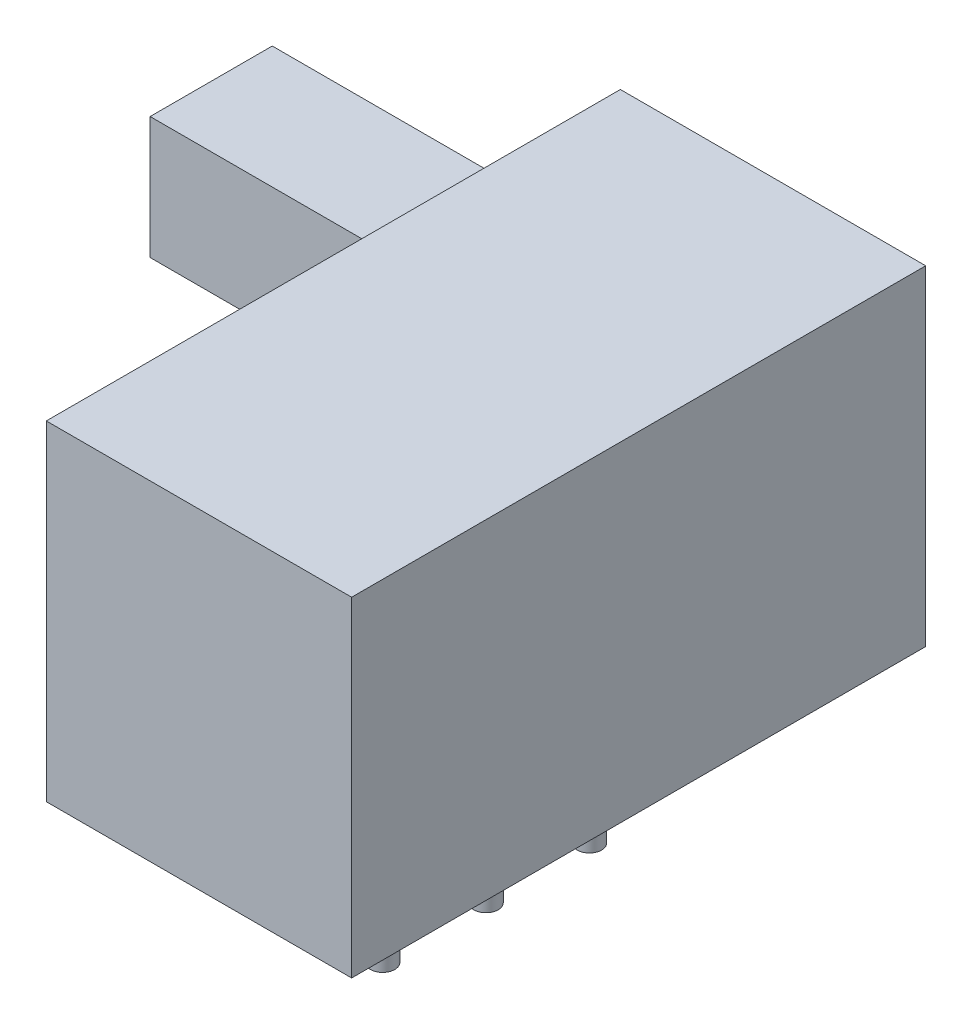
ISO-10303-21;
HEADER;
FILE_DESCRIPTION(('STEP AP214'),'2;1');
FILE_NAME('part.step','',(''),(''),'','','');
FILE_SCHEMA(('AUTOMOTIVE_DESIGN { 1 0 10303 214 1 1 1 1 }'));
ENDSEC;
DATA;
#1=APPLICATION_CONTEXT('core data for automotive mechanical design processes');
#2=APPLICATION_PROTOCOL_DEFINITION('international standard','automotive_design',2000,#1);
#3=PRODUCT_CONTEXT('',#1,'mechanical');
#4=PRODUCT('Part','Part','',(#3));
#5=PRODUCT_RELATED_PRODUCT_CATEGORY('part','',(#4));
#6=PRODUCT_DEFINITION_FORMATION('','',#4);
#7=PRODUCT_DEFINITION_CONTEXT('part definition',#1,'design');
#8=PRODUCT_DEFINITION('design','',#6,#7);
#9=PRODUCT_DEFINITION_SHAPE('','',#8);
#10=(LENGTH_UNIT() NAMED_UNIT(*) SI_UNIT(.MILLI.,.METRE.));
#11=(NAMED_UNIT(*) PLANE_ANGLE_UNIT() SI_UNIT($,.RADIAN.));
#12=(NAMED_UNIT(*) SI_UNIT($,.STERADIAN.) SOLID_ANGLE_UNIT());
#13=UNCERTAINTY_MEASURE_WITH_UNIT(LENGTH_MEASURE(1.E-05),#10,'distance_accuracy_value','');
#14=(GEOMETRIC_REPRESENTATION_CONTEXT(3) GLOBAL_UNCERTAINTY_ASSIGNED_CONTEXT((#13)) GLOBAL_UNIT_ASSIGNED_CONTEXT((#10,
#11,#12)) REPRESENTATION_CONTEXT('',''));
#15=CARTESIAN_POINT('',(0.,0.,0.));
#16=DIRECTION('',(0.,0.,1.));
#17=DIRECTION('',(1.,0.,0.));
#18=AXIS2_PLACEMENT_3D('',#15,#16,#17);
#19=CARTESIAN_POINT('',(-3.75,8.1,-7.05));
#20=DIRECTION('',(1.,0.,0.));
#21=DIRECTION('',(0.,0.,-1.));
#22=AXIS2_PLACEMENT_3D('',#19,#20,#21);
#23=PLANE('',#22);
#24=DIRECTION('',(0.,0.,1.));
#25=VECTOR('',#24,1.);
#26=CARTESIAN_POINT('',(-3.75,0.,-7.05));
#27=LINE('',#26,#25);
#28=CARTESIAN_POINT('',(-3.75,0.,-7.05));
#29=VERTEX_POINT('',#28);
#30=CARTESIAN_POINT('',(-3.75,0.,7.05));
#31=VERTEX_POINT('',#30);
#32=EDGE_CURVE('E143',#29,#31,#27,.T.);
#33=ORIENTED_EDGE('',*,*,#32,.T.);
#34=DIRECTION('',(0.,-1.,0.));
#35=VECTOR('',#34,1.);
#36=CARTESIAN_POINT('',(-3.75,8.1,7.05));
#37=LINE('',#36,#35);
#38=CARTESIAN_POINT('',(-3.75,8.1,7.05));
#39=VERTEX_POINT('',#38);
#40=EDGE_CURVE('E180',#39,#31,#37,.T.);
#41=ORIENTED_EDGE('',*,*,#40,.F.);
#42=DIRECTION('',(0.,0.,1.));
#43=VECTOR('',#42,1.);
#44=CARTESIAN_POINT('',(-3.75,8.1,-7.05));
#45=LINE('',#44,#43);
#46=CARTESIAN_POINT('',(-3.75,8.1,-7.05));
#47=VERTEX_POINT('',#46);
#48=EDGE_CURVE('E144',#47,#39,#45,.T.);
#49=ORIENTED_EDGE('',*,*,#48,.F.);
#50=DIRECTION('',(0.,-1.,0.));
#51=VECTOR('',#50,1.);
#52=CARTESIAN_POINT('',(-3.75,8.1,-7.05));
#53=LINE('',#52,#51);
#54=EDGE_CURVE('E158',#47,#29,#53,.T.);
#55=ORIENTED_EDGE('',*,*,#54,.T.);
#56=EDGE_LOOP('',(#33,#41,#49,#55));
#57=FACE_BOUND('',#56,.T.);
#58=DIRECTION('',(0.,-1.,0.));
#59=VECTOR('',#58,1.);
#60=CARTESIAN_POINT('',(-3.75,7.3,-4.5));
#61=LINE('',#60,#59);
#62=CARTESIAN_POINT('',(-3.75,7.3,-4.5));
#63=VERTEX_POINT('',#62);
#64=CARTESIAN_POINT('',(-3.75,4.3,-4.5));
#65=VERTEX_POINT('',#64);
#66=EDGE_CURVE('E125',#63,#65,#61,.T.);
#67=ORIENTED_EDGE('',*,*,#66,.F.);
#68=DIRECTION('',(0.,0.,-1.));
#69=VECTOR('',#68,1.);
#70=CARTESIAN_POINT('',(-3.75,7.3,-4.5));
#71=LINE('',#70,#69);
#72=CARTESIAN_POINT('',(-3.75,7.3,-1.5));
#73=VERTEX_POINT('',#72);
#74=EDGE_CURVE('E122',#73,#63,#71,.T.);
#75=ORIENTED_EDGE('',*,*,#74,.F.);
#76=DIRECTION('',(0.,1.,0.));
#77=VECTOR('',#76,1.);
#78=CARTESIAN_POINT('',(-3.75,7.3,-1.5));
#79=LINE('',#78,#77);
#80=CARTESIAN_POINT('',(-3.75,4.3,-1.5));
#81=VERTEX_POINT('',#80);
#82=EDGE_CURVE('E58',#81,#73,#79,.T.);
#83=ORIENTED_EDGE('',*,*,#82,.F.);
#84=DIRECTION('',(0.,0.,1.));
#85=VECTOR('',#84,1.);
#86=CARTESIAN_POINT('',(-3.75,4.3,-4.5));
#87=LINE('',#86,#85);
#88=EDGE_CURVE('E53',#65,#81,#87,.T.);
#89=ORIENTED_EDGE('',*,*,#88,.F.);
#90=EDGE_LOOP('',(#67,#75,#83,#89));
#91=FACE_BOUND('',#90,.T.);
#92=ADVANCED_FACE('F37',(#57,#91),#23,.F.);
#93=CARTESIAN_POINT('',(0.,-3.8,0.));
#94=DIRECTION('',(0.,1.,0.));
#95=DIRECTION('',(0.,0.,1.));
#96=AXIS2_PLACEMENT_3D('',#93,#94,#95);
#97=CYLINDRICAL_SURFACE('',#96,0.3);
#98=CARTESIAN_POINT('',(0.,-3.8,0.));
#99=DIRECTION('',(0.,1.,0.));
#100=DIRECTION('',(0.,0.,1.));
#101=AXIS2_PLACEMENT_3D('',#98,#99,#100);
#102=CIRCLE('',#101,0.3);
#103=CARTESIAN_POINT('',(0.,-3.8,0.3));
#104=VERTEX_POINT('',#103);
#105=EDGE_CURVE('E185',#104,#104,#102,.T.);
#106=ORIENTED_EDGE('',*,*,#105,.T.);
#107=EDGE_LOOP('',(#106));
#108=FACE_BOUND('',#107,.T.);
#109=CARTESIAN_POINT('',(0.,0.,0.));
#110=DIRECTION('',(0.,1.,0.));
#111=DIRECTION('',(0.,0.,1.));
#112=AXIS2_PLACEMENT_3D('',#109,#110,#111);
#113=CIRCLE('',#112,0.3);
#114=CARTESIAN_POINT('',(0.,0.,0.3));
#115=VERTEX_POINT('',#114);
#116=EDGE_CURVE('E184',#115,#115,#113,.T.);
#117=ORIENTED_EDGE('',*,*,#116,.F.);
#118=EDGE_LOOP('',(#117));
#119=FACE_BOUND('',#118,.T.);
#120=ADVANCED_FACE('F39',(#108,#119),#97,.T.);
#121=CARTESIAN_POINT('',(0.,-3.8,0.));
#122=DIRECTION('',(0.,1.,0.));
#123=DIRECTION('',(0.,0.,1.));
#124=AXIS2_PLACEMENT_3D('',#121,#122,#123);
#125=PLANE('',#124);
#126=ORIENTED_EDGE('',*,*,#105,.F.);
#127=EDGE_LOOP('',(#126));
#128=FACE_BOUND('',#127,.T.);
#129=ADVANCED_FACE('F236',(#128),#125,.F.);
#130=CARTESIAN_POINT('',(3.75,8.1,7.05));
#131=DIRECTION('',(0.,0.,-1.));
#132=DIRECTION('',(-1.,0.,0.));
#133=AXIS2_PLACEMENT_3D('',#130,#131,#132);
#134=PLANE('',#133);
#135=DIRECTION('',(1.,0.,0.));
#136=VECTOR('',#135,1.);
#137=CARTESIAN_POINT('',(3.75,0.,7.05));
#138=LINE('',#137,#136);
#139=CARTESIAN_POINT('',(3.75,0.,7.05));
#140=VERTEX_POINT('',#139);
#141=EDGE_CURVE('E162',#31,#140,#138,.T.);
#142=ORIENTED_EDGE('',*,*,#141,.T.);
#143=DIRECTION('',(0.,-1.,0.));
#144=VECTOR('',#143,1.);
#145=CARTESIAN_POINT('',(3.75,8.1,7.05));
#146=LINE('',#145,#144);
#147=CARTESIAN_POINT('',(3.75,8.1,7.05));
#148=VERTEX_POINT('',#147);
#149=EDGE_CURVE('E176',#148,#140,#146,.T.);
#150=ORIENTED_EDGE('',*,*,#149,.F.);
#151=DIRECTION('',(1.,0.,0.));
#152=VECTOR('',#151,1.);
#153=CARTESIAN_POINT('',(3.75,8.1,7.05));
#154=LINE('',#153,#152);
#155=EDGE_CURVE('E148',#39,#148,#154,.T.);
#156=ORIENTED_EDGE('',*,*,#155,.F.);
#157=ORIENTED_EDGE('',*,*,#40,.T.);
#158=EDGE_LOOP('',(#142,#150,#156,#157));
#159=FACE_BOUND('',#158,.T.);
#160=ADVANCED_FACE('F222',(#159),#134,.F.);
#161=CARTESIAN_POINT('',(3.75,8.1,-7.05));
#162=DIRECTION('',(-1.,0.,0.));
#163=DIRECTION('',(0.,0.,1.));
#164=AXIS2_PLACEMENT_3D('',#161,#162,#163);
#165=PLANE('',#164);
#166=DIRECTION('',(0.,0.,-1.));
#167=VECTOR('',#166,1.);
#168=CARTESIAN_POINT('',(3.75,0.,-7.05));
#169=LINE('',#168,#167);
#170=CARTESIAN_POINT('',(3.75,0.,-7.05));
#171=VERTEX_POINT('',#170);
#172=EDGE_CURVE('E164',#140,#171,#169,.T.);
#173=ORIENTED_EDGE('',*,*,#172,.T.);
#174=DIRECTION('',(0.,-1.,0.));
#175=VECTOR('',#174,1.);
#176=CARTESIAN_POINT('',(3.75,8.1,-7.05));
#177=LINE('',#176,#175);
#178=CARTESIAN_POINT('',(3.75,8.1,-7.05));
#179=VERTEX_POINT('',#178);
#180=EDGE_CURVE('E172',#179,#171,#177,.T.);
#181=ORIENTED_EDGE('',*,*,#180,.F.);
#182=DIRECTION('',(0.,0.,-1.));
#183=VECTOR('',#182,1.);
#184=CARTESIAN_POINT('',(3.75,8.1,-7.05));
#185=LINE('',#184,#183);
#186=EDGE_CURVE('E152',#148,#179,#185,.T.);
#187=ORIENTED_EDGE('',*,*,#186,.F.);
#188=ORIENTED_EDGE('',*,*,#149,.T.);
#189=EDGE_LOOP('',(#173,#181,#187,#188));
#190=FACE_BOUND('',#189,.T.);
#191=ADVANCED_FACE('F219',(#190),#165,.F.);
#192=CARTESIAN_POINT('',(3.75,8.1,-7.05));
#193=DIRECTION('',(0.,0.,1.));
#194=DIRECTION('',(1.,0.,0.));
#195=AXIS2_PLACEMENT_3D('',#192,#193,#194);
#196=PLANE('',#195);
#197=DIRECTION('',(-1.,0.,0.));
#198=VECTOR('',#197,1.);
#199=CARTESIAN_POINT('',(3.75,0.,-7.05));
#200=LINE('',#199,#198);
#201=EDGE_CURVE('E149',#171,#29,#200,.T.);
#202=ORIENTED_EDGE('',*,*,#201,.T.);
#203=ORIENTED_EDGE('',*,*,#54,.F.);
#204=DIRECTION('',(-1.,0.,0.));
#205=VECTOR('',#204,1.);
#206=CARTESIAN_POINT('',(3.75,8.1,-7.05));
#207=LINE('',#206,#205);
#208=EDGE_CURVE('E155',#179,#47,#207,.T.);
#209=ORIENTED_EDGE('',*,*,#208,.F.);
#210=ORIENTED_EDGE('',*,*,#180,.T.);
#211=EDGE_LOOP('',(#202,#203,#209,#210));
#212=FACE_BOUND('',#211,.T.);
#213=ADVANCED_FACE('F215',(#212),#196,.F.);
#214=CARTESIAN_POINT('',(0.,8.1,0.));
#215=DIRECTION('',(0.,-1.,0.));
#216=DIRECTION('',(0.,0.,-1.));
#217=AXIS2_PLACEMENT_3D('',#214,#215,#216);
#218=PLANE('',#217);
#219=ORIENTED_EDGE('',*,*,#48,.T.);
#220=ORIENTED_EDGE('',*,*,#155,.T.);
#221=ORIENTED_EDGE('',*,*,#186,.T.);
#222=ORIENTED_EDGE('',*,*,#208,.T.);
#223=EDGE_LOOP('',(#219,#220,#221,#222));
#224=FACE_BOUND('',#223,.T.);
#225=ADVANCED_FACE('F201',(#224),#218,.F.);
#226=CARTESIAN_POINT('',(0.,0.,0.));
#227=DIRECTION('',(0.,-1.,0.));
#228=DIRECTION('',(0.,0.,-1.));
#229=AXIS2_PLACEMENT_3D('',#226,#227,#228);
#230=PLANE('',#229);
#231=CARTESIAN_POINT('',(0.,0.,-2.54));
#232=DIRECTION('',(0.,-1.,0.));
#233=DIRECTION('',(0.,0.,-1.));
#234=AXIS2_PLACEMENT_3D('',#231,#232,#233);
#235=CIRCLE('',#234,0.3);
#236=CARTESIAN_POINT('',(0.,0.,-2.84));
#237=VERTEX_POINT('',#236);
#238=EDGE_CURVE('E11',#237,#237,#235,.T.);
#239=ORIENTED_EDGE('',*,*,#238,.F.);
#240=EDGE_LOOP('',(#239));
#241=FACE_BOUND('',#240,.T.);
#242=CARTESIAN_POINT('',(0.,0.,2.54));
#243=DIRECTION('',(0.,-1.,0.));
#244=DIRECTION('',(0.,0.,-1.));
#245=AXIS2_PLACEMENT_3D('',#242,#243,#244);
#246=CIRCLE('',#245,0.3);
#247=CARTESIAN_POINT('',(0.,0.,2.24));
#248=VERTEX_POINT('',#247);
#249=EDGE_CURVE('E46',#248,#248,#246,.T.);
#250=ORIENTED_EDGE('',*,*,#249,.F.);
#251=EDGE_LOOP('',(#250));
#252=FACE_BOUND('',#251,.T.);
#253=ORIENTED_EDGE('',*,*,#116,.T.);
#254=EDGE_LOOP('',(#253));
#255=FACE_BOUND('',#254,.T.);
#256=ORIENTED_EDGE('',*,*,#32,.F.);
#257=ORIENTED_EDGE('',*,*,#201,.F.);
#258=ORIENTED_EDGE('',*,*,#172,.F.);
#259=ORIENTED_EDGE('',*,*,#141,.F.);
#260=EDGE_LOOP('',(#256,#257,#258,#259));
#261=FACE_BOUND('',#260,.T.);
#262=ADVANCED_FACE('F198',(#241,#252,#255,#261),#230,.T.);
#263=CARTESIAN_POINT('',(0.,-3.8,2.54));
#264=DIRECTION('',(0.,1.,0.));
#265=DIRECTION('',(0.,0.,1.));
#266=AXIS2_PLACEMENT_3D('',#263,#264,#265);
#267=CYLINDRICAL_SURFACE('',#266,0.3);
#268=CARTESIAN_POINT('',(0.,-3.8,2.54));
#269=DIRECTION('',(0.,1.,0.));
#270=DIRECTION('',(0.,0.,1.));
#271=AXIS2_PLACEMENT_3D('',#268,#269,#270);
#272=CIRCLE('',#271,0.3);
#273=CARTESIAN_POINT('',(0.,-3.8,2.84));
#274=VERTEX_POINT('',#273);
#275=EDGE_CURVE('E133',#274,#274,#272,.T.);
#276=ORIENTED_EDGE('',*,*,#275,.T.);
#277=EDGE_LOOP('',(#276));
#278=FACE_BOUND('',#277,.T.);
#279=ORIENTED_EDGE('',*,*,#249,.T.);
#280=EDGE_LOOP('',(#279));
#281=FACE_BOUND('',#280,.T.);
#282=ADVANCED_FACE('F196',(#278,#281),#267,.T.);
#283=CARTESIAN_POINT('',(0.,-3.8,2.54));
#284=DIRECTION('',(0.,1.,0.));
#285=DIRECTION('',(0.,0.,1.));
#286=AXIS2_PLACEMENT_3D('',#283,#284,#285);
#287=PLANE('',#286);
#288=ORIENTED_EDGE('',*,*,#275,.F.);
#289=EDGE_LOOP('',(#288));
#290=FACE_BOUND('',#289,.T.);
#291=ADVANCED_FACE('F270',(#290),#287,.F.);
#292=CARTESIAN_POINT('',(0.,-3.8,-2.54));
#293=DIRECTION('',(0.,1.,0.));
#294=DIRECTION('',(0.,0.,1.));
#295=AXIS2_PLACEMENT_3D('',#292,#293,#294);
#296=CYLINDRICAL_SURFACE('',#295,0.3);
#297=CARTESIAN_POINT('',(0.,-3.8,-2.54));
#298=DIRECTION('',(0.,1.,0.));
#299=DIRECTION('',(0.,0.,1.));
#300=AXIS2_PLACEMENT_3D('',#297,#298,#299);
#301=CIRCLE('',#300,0.3);
#302=CARTESIAN_POINT('',(0.,-3.8,-2.24));
#303=VERTEX_POINT('',#302);
#304=EDGE_CURVE('E127',#303,#303,#301,.T.);
#305=ORIENTED_EDGE('',*,*,#304,.T.);
#306=EDGE_LOOP('',(#305));
#307=FACE_BOUND('',#306,.T.);
#308=ORIENTED_EDGE('',*,*,#238,.T.);
#309=EDGE_LOOP('',(#308));
#310=FACE_BOUND('',#309,.T.);
#311=ADVANCED_FACE('F278',(#307,#310),#296,.T.);
#312=CARTESIAN_POINT('',(0.,-3.8,-2.54));
#313=DIRECTION('',(0.,1.,0.));
#314=DIRECTION('',(0.,0.,1.));
#315=AXIS2_PLACEMENT_3D('',#312,#313,#314);
#316=PLANE('',#315);
#317=ORIENTED_EDGE('',*,*,#304,.F.);
#318=EDGE_LOOP('',(#317));
#319=FACE_BOUND('',#318,.T.);
#320=ADVANCED_FACE('F287',(#319),#316,.F.);
#321=CARTESIAN_POINT('',(-9.75,7.3,-4.5));
#322=DIRECTION('',(0.,0.,1.));
#323=DIRECTION('',(0.,-1.,0.));
#324=AXIS2_PLACEMENT_3D('',#321,#322,#323);
#325=PLANE('',#324);
#326=ORIENTED_EDGE('',*,*,#66,.T.);
#327=DIRECTION('',(1.,0.,0.));
#328=VECTOR('',#327,1.);
#329=CARTESIAN_POINT('',(-9.75,4.3,-4.5));
#330=LINE('',#329,#328);
#331=CARTESIAN_POINT('',(-9.75,4.3,-4.5));
#332=VERTEX_POINT('',#331);
#333=EDGE_CURVE('E104',#332,#65,#330,.T.);
#334=ORIENTED_EDGE('',*,*,#333,.F.);
#335=DIRECTION('',(0.,-1.,0.));
#336=VECTOR('',#335,1.);
#337=CARTESIAN_POINT('',(-9.75,7.3,-4.5));
#338=LINE('',#337,#336);
#339=CARTESIAN_POINT('',(-9.75,7.3,-4.5));
#340=VERTEX_POINT('',#339);
#341=EDGE_CURVE('E112',#340,#332,#338,.T.);
#342=ORIENTED_EDGE('',*,*,#341,.F.);
#343=DIRECTION('',(1.,0.,0.));
#344=VECTOR('',#343,1.);
#345=CARTESIAN_POINT('',(-9.75,7.3,-4.5));
#346=LINE('',#345,#344);
#347=EDGE_CURVE('E391',#340,#63,#346,.T.);
#348=ORIENTED_EDGE('',*,*,#347,.T.);
#349=EDGE_LOOP('',(#326,#334,#342,#348));
#350=FACE_BOUND('',#349,.T.);
#351=ADVANCED_FACE('F124',(#350),#325,.F.);
#352=CARTESIAN_POINT('',(-9.75,4.3,-4.5));
#353=DIRECTION('',(0.,1.,0.));
#354=DIRECTION('',(0.,0.,1.));
#355=AXIS2_PLACEMENT_3D('',#352,#353,#354);
#356=PLANE('',#355);
#357=ORIENTED_EDGE('',*,*,#88,.T.);
#358=DIRECTION('',(1.,0.,0.));
#359=VECTOR('',#358,1.);
#360=CARTESIAN_POINT('',(-9.75,4.3,-1.5));
#361=LINE('',#360,#359);
#362=CARTESIAN_POINT('',(-9.75,4.3,-1.5));
#363=VERTEX_POINT('',#362);
#364=EDGE_CURVE('E107',#363,#81,#361,.T.);
#365=ORIENTED_EDGE('',*,*,#364,.F.);
#366=DIRECTION('',(0.,0.,1.));
#367=VECTOR('',#366,1.);
#368=CARTESIAN_POINT('',(-9.75,4.3,-4.5));
#369=LINE('',#368,#367);
#370=EDGE_CURVE('E100',#332,#363,#369,.T.);
#371=ORIENTED_EDGE('',*,*,#370,.F.);
#372=ORIENTED_EDGE('',*,*,#333,.T.);
#373=EDGE_LOOP('',(#357,#365,#371,#372));
#374=FACE_BOUND('',#373,.T.);
#375=ADVANCED_FACE('F102',(#374),#356,.F.);
#376=CARTESIAN_POINT('',(-9.75,7.3,-1.5));
#377=DIRECTION('',(0.,0.,-1.));
#378=DIRECTION('',(0.,1.,0.));
#379=AXIS2_PLACEMENT_3D('',#376,#377,#378);
#380=PLANE('',#379);
#381=ORIENTED_EDGE('',*,*,#82,.T.);
#382=DIRECTION('',(1.,0.,0.));
#383=VECTOR('',#382,1.);
#384=CARTESIAN_POINT('',(-9.75,7.3,-1.5));
#385=LINE('',#384,#383);
#386=CARTESIAN_POINT('',(-9.75,7.3,-1.5));
#387=VERTEX_POINT('',#386);
#388=EDGE_CURVE('E136',#387,#73,#385,.T.);
#389=ORIENTED_EDGE('',*,*,#388,.F.);
#390=DIRECTION('',(0.,1.,0.));
#391=VECTOR('',#390,1.);
#392=CARTESIAN_POINT('',(-9.75,7.3,-1.5));
#393=LINE('',#392,#391);
#394=EDGE_CURVE('E111',#363,#387,#393,.T.);
#395=ORIENTED_EDGE('',*,*,#394,.F.);
#396=ORIENTED_EDGE('',*,*,#364,.T.);
#397=EDGE_LOOP('',(#381,#389,#395,#396));
#398=FACE_BOUND('',#397,.T.);
#399=ADVANCED_FACE('F312',(#398),#380,.F.);
#400=CARTESIAN_POINT('',(-9.75,7.3,-4.5));
#401=DIRECTION('',(0.,-1.,0.));
#402=DIRECTION('',(0.,0.,-1.));
#403=AXIS2_PLACEMENT_3D('',#400,#401,#402);
#404=PLANE('',#403);
#405=ORIENTED_EDGE('',*,*,#74,.T.);
#406=ORIENTED_EDGE('',*,*,#347,.F.);
#407=DIRECTION('',(0.,0.,-1.));
#408=VECTOR('',#407,1.);
#409=CARTESIAN_POINT('',(-9.75,7.3,-4.5));
#410=LINE('',#409,#408);
#411=EDGE_CURVE('E117',#387,#340,#410,.T.);
#412=ORIENTED_EDGE('',*,*,#411,.F.);
#413=ORIENTED_EDGE('',*,*,#388,.T.);
#414=EDGE_LOOP('',(#405,#406,#412,#413));
#415=FACE_BOUND('',#414,.T.);
#416=ADVANCED_FACE('F320',(#415),#404,.F.);
#417=CARTESIAN_POINT('',(-9.75,0.,0.));
#418=DIRECTION('',(-1.,0.,0.));
#419=DIRECTION('',(0.,0.,1.));
#420=AXIS2_PLACEMENT_3D('',#417,#418,#419);
#421=PLANE('',#420);
#422=ORIENTED_EDGE('',*,*,#341,.T.);
#423=ORIENTED_EDGE('',*,*,#370,.T.);
#424=ORIENTED_EDGE('',*,*,#394,.T.);
#425=ORIENTED_EDGE('',*,*,#411,.T.);
#426=EDGE_LOOP('',(#422,#423,#424,#425));
#427=FACE_BOUND('',#426,.T.);
#428=ADVANCED_FACE('F115',(#427),#421,.T.);
#429=CLOSED_SHELL('',(#92,#120,#129,#160,#191,#213,#225,#262,#282,#291,#311,#320,#351,#375,#399,
#416,#428));
#430=MANIFOLD_SOLID_BREP('B2',#429);
#431=ADVANCED_BREP_SHAPE_REPRESENTATION('',(#18,#430),#14);
#432=SHAPE_DEFINITION_REPRESENTATION(#9,#431);
ENDSEC;
END-ISO-10303-21;
